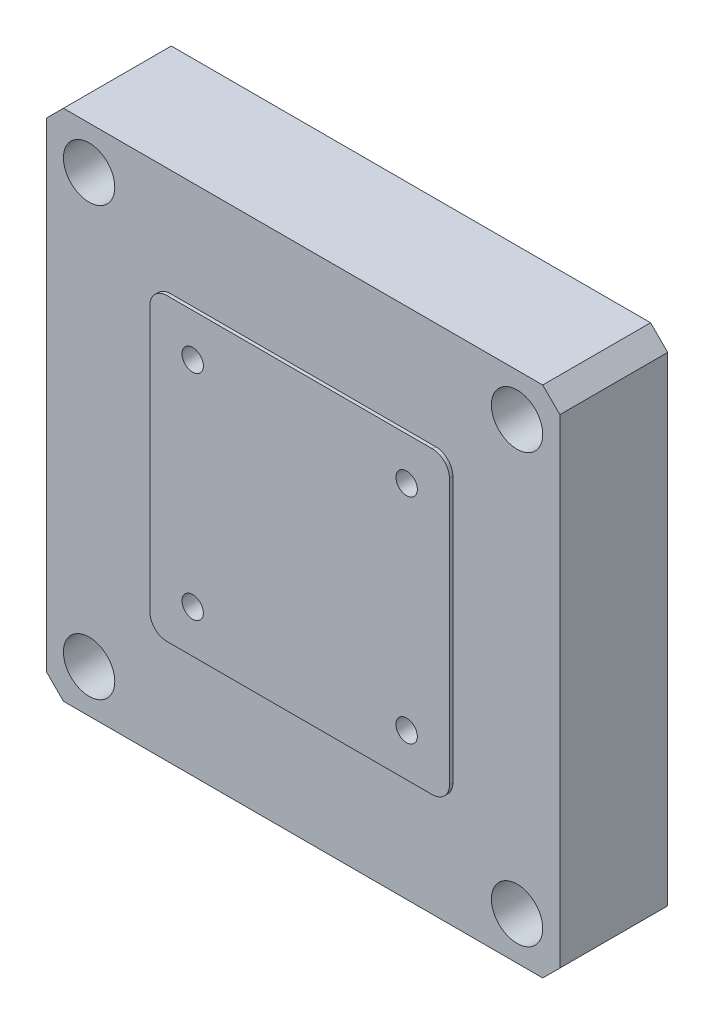
ISO-10303-21;
HEADER;
FILE_DESCRIPTION(('STEP AP214'),'2;1');
FILE_NAME('part.step','',(''),(''),'','','');
FILE_SCHEMA(('AUTOMOTIVE_DESIGN { 1 0 10303 214 1 1 1 1 }'));
ENDSEC;
DATA;
#1=APPLICATION_CONTEXT('core data for automotive mechanical design processes');
#2=APPLICATION_PROTOCOL_DEFINITION('international standard','automotive_design',2000,#1);
#3=PRODUCT_CONTEXT('',#1,'mechanical');
#4=PRODUCT('Part','Part','',(#3));
#5=PRODUCT_RELATED_PRODUCT_CATEGORY('part','',(#4));
#6=PRODUCT_DEFINITION_FORMATION('','',#4);
#7=PRODUCT_DEFINITION_CONTEXT('part definition',#1,'design');
#8=PRODUCT_DEFINITION('design','',#6,#7);
#9=PRODUCT_DEFINITION_SHAPE('','',#8);
#10=(LENGTH_UNIT() NAMED_UNIT(*) SI_UNIT(.MILLI.,.METRE.));
#11=(NAMED_UNIT(*) PLANE_ANGLE_UNIT() SI_UNIT($,.RADIAN.));
#12=(NAMED_UNIT(*) SI_UNIT($,.STERADIAN.) SOLID_ANGLE_UNIT());
#13=UNCERTAINTY_MEASURE_WITH_UNIT(LENGTH_MEASURE(1.E-05),#10,'distance_accuracy_value','');
#14=(GEOMETRIC_REPRESENTATION_CONTEXT(3) GLOBAL_UNCERTAINTY_ASSIGNED_CONTEXT((#13)) GLOBAL_UNIT_ASSIGNED_CONTEXT((#10,
#11,#12)) REPRESENTATION_CONTEXT('',''));
#15=CARTESIAN_POINT('',(0.,0.,0.));
#16=DIRECTION('',(0.,0.,1.));
#17=DIRECTION('',(1.,0.,0.));
#18=AXIS2_PLACEMENT_3D('',#15,#16,#17);
#19=CARTESIAN_POINT('',(30.,30.,12.6));
#20=DIRECTION('',(-1.,0.,0.));
#21=DIRECTION('',(0.,-1.,0.));
#22=AXIS2_PLACEMENT_3D('',#19,#20,#21);
#23=PLANE('',#22);
#24=DIRECTION('',(0.,1.,0.));
#25=VECTOR('',#24,1.);
#26=CARTESIAN_POINT('',(30.,30.,12.6));
#27=LINE('',#26,#25);
#28=CARTESIAN_POINT('',(30.,-28.,12.6));
#29=VERTEX_POINT('',#28);
#30=CARTESIAN_POINT('',(30.,28.,12.6));
#31=VERTEX_POINT('',#30);
#32=EDGE_CURVE('E301',#29,#31,#27,.T.);
#33=ORIENTED_EDGE('',*,*,#32,.F.);
#34=DIRECTION('',(0.,0.,-1.));
#35=VECTOR('',#34,1.);
#36=CARTESIAN_POINT('',(30.,-28.,12.6));
#37=LINE('',#36,#35);
#38=CARTESIAN_POINT('',(30.,-28.,0.));
#39=VERTEX_POINT('',#38);
#40=EDGE_CURVE('E373',#29,#39,#37,.T.);
#41=ORIENTED_EDGE('',*,*,#40,.T.);
#42=DIRECTION('',(0.,1.,0.));
#43=VECTOR('',#42,1.);
#44=CARTESIAN_POINT('',(30.,30.,0.));
#45=LINE('',#44,#43);
#46=CARTESIAN_POINT('',(30.,28.,0.));
#47=VERTEX_POINT('',#46);
#48=EDGE_CURVE('E287',#39,#47,#45,.T.);
#49=ORIENTED_EDGE('',*,*,#48,.T.);
#50=DIRECTION('',(0.,0.,1.));
#51=VECTOR('',#50,1.);
#52=CARTESIAN_POINT('',(30.,28.,12.6));
#53=LINE('',#52,#51);
#54=EDGE_CURVE('E370',#47,#31,#53,.T.);
#55=ORIENTED_EDGE('',*,*,#54,.T.);
#56=EDGE_LOOP('',(#33,#41,#49,#55));
#57=FACE_BOUND('',#56,.T.);
#58=ADVANCED_FACE('F41',(#57),#23,.F.);
#59=CARTESIAN_POINT('',(-30.,30.,12.6));
#60=DIRECTION('',(0.,-1.,0.));
#61=DIRECTION('',(0.,0.,-1.));
#62=AXIS2_PLACEMENT_3D('',#59,#60,#61);
#63=PLANE('',#62);
#64=DIRECTION('',(-1.,0.,0.));
#65=VECTOR('',#64,1.);
#66=CARTESIAN_POINT('',(-30.,30.,12.6));
#67=LINE('',#66,#65);
#68=CARTESIAN_POINT('',(28.,30.,12.6));
#69=VERTEX_POINT('',#68);
#70=CARTESIAN_POINT('',(-28.,30.,12.6));
#71=VERTEX_POINT('',#70);
#72=EDGE_CURVE('E305',#69,#71,#67,.T.);
#73=ORIENTED_EDGE('',*,*,#72,.F.);
#74=DIRECTION('',(0.,0.,-1.));
#75=VECTOR('',#74,1.);
#76=CARTESIAN_POINT('',(28.,30.,12.6));
#77=LINE('',#76,#75);
#78=CARTESIAN_POINT('',(28.,30.,0.));
#79=VERTEX_POINT('',#78);
#80=EDGE_CURVE('E380',#69,#79,#77,.T.);
#81=ORIENTED_EDGE('',*,*,#80,.T.);
#82=DIRECTION('',(-1.,0.,0.));
#83=VECTOR('',#82,1.);
#84=CARTESIAN_POINT('',(-30.,30.,0.));
#85=LINE('',#84,#83);
#86=CARTESIAN_POINT('',(-28.,30.,0.));
#87=VERTEX_POINT('',#86);
#88=EDGE_CURVE('E322',#79,#87,#85,.T.);
#89=ORIENTED_EDGE('',*,*,#88,.T.);
#90=DIRECTION('',(0.,0.,1.));
#91=VECTOR('',#90,1.);
#92=CARTESIAN_POINT('',(-28.,30.,12.6));
#93=LINE('',#92,#91);
#94=EDGE_CURVE('E377',#87,#71,#93,.T.);
#95=ORIENTED_EDGE('',*,*,#94,.T.);
#96=EDGE_LOOP('',(#73,#81,#89,#95));
#97=FACE_BOUND('',#96,.T.);
#98=ADVANCED_FACE('F474',(#97),#63,.F.);
#99=CARTESIAN_POINT('',(-30.,30.,12.6));
#100=DIRECTION('',(1.,0.,0.));
#101=DIRECTION('',(0.,1.,0.));
#102=AXIS2_PLACEMENT_3D('',#99,#100,#101);
#103=PLANE('',#102);
#104=DIRECTION('',(0.,-1.,0.));
#105=VECTOR('',#104,1.);
#106=CARTESIAN_POINT('',(-30.,30.,0.));
#107=LINE('',#106,#105);
#108=CARTESIAN_POINT('',(-30.,28.,0.));
#109=VERTEX_POINT('',#108);
#110=CARTESIAN_POINT('',(-30.,-28.,0.));
#111=VERTEX_POINT('',#110);
#112=EDGE_CURVE('E326',#109,#111,#107,.T.);
#113=ORIENTED_EDGE('',*,*,#112,.T.);
#114=DIRECTION('',(0.,0.,1.));
#115=VECTOR('',#114,1.);
#116=CARTESIAN_POINT('',(-30.,-28.,12.6));
#117=LINE('',#116,#115);
#118=CARTESIAN_POINT('',(-30.,-28.,12.6));
#119=VERTEX_POINT('',#118);
#120=EDGE_CURVE('E355',#111,#119,#117,.T.);
#121=ORIENTED_EDGE('',*,*,#120,.T.);
#122=DIRECTION('',(0.,-1.,0.));
#123=VECTOR('',#122,1.);
#124=CARTESIAN_POINT('',(-30.,30.,12.6));
#125=LINE('',#124,#123);
#126=CARTESIAN_POINT('',(-30.,28.,12.6));
#127=VERTEX_POINT('',#126);
#128=EDGE_CURVE('E310',#127,#119,#125,.T.);
#129=ORIENTED_EDGE('',*,*,#128,.F.);
#130=DIRECTION('',(0.,0.,-1.));
#131=VECTOR('',#130,1.);
#132=CARTESIAN_POINT('',(-30.,28.,12.6));
#133=LINE('',#132,#131);
#134=EDGE_CURVE('E351',#127,#109,#133,.T.);
#135=ORIENTED_EDGE('',*,*,#134,.T.);
#136=EDGE_LOOP('',(#113,#121,#129,#135));
#137=FACE_BOUND('',#136,.T.);
#138=ADVANCED_FACE('F480',(#137),#103,.F.);
#139=CARTESIAN_POINT('',(-30.,-30.,12.6));
#140=DIRECTION('',(0.,1.,0.));
#141=DIRECTION('',(0.,0.,1.));
#142=AXIS2_PLACEMENT_3D('',#139,#140,#141);
#143=PLANE('',#142);
#144=DIRECTION('',(1.,0.,0.));
#145=VECTOR('',#144,1.);
#146=CARTESIAN_POINT('',(-30.,-30.,12.6));
#147=LINE('',#146,#145);
#148=CARTESIAN_POINT('',(-28.,-30.,12.6));
#149=VERTEX_POINT('',#148);
#150=CARTESIAN_POINT('',(28.,-30.,12.6));
#151=VERTEX_POINT('',#150);
#152=EDGE_CURVE('E314',#149,#151,#147,.T.);
#153=ORIENTED_EDGE('',*,*,#152,.F.);
#154=DIRECTION('',(0.,0.,-1.));
#155=VECTOR('',#154,1.);
#156=CARTESIAN_POINT('',(-28.,-30.,12.6));
#157=LINE('',#156,#155);
#158=CARTESIAN_POINT('',(-28.,-30.,0.));
#159=VERTEX_POINT('',#158);
#160=EDGE_CURVE('E335',#149,#159,#157,.T.);
#161=ORIENTED_EDGE('',*,*,#160,.T.);
#162=DIRECTION('',(1.,0.,0.));
#163=VECTOR('',#162,1.);
#164=CARTESIAN_POINT('',(-30.,-30.,0.));
#165=LINE('',#164,#163);
#166=CARTESIAN_POINT('',(28.,-30.,0.));
#167=VERTEX_POINT('',#166);
#168=EDGE_CURVE('E306',#159,#167,#165,.T.);
#169=ORIENTED_EDGE('',*,*,#168,.T.);
#170=DIRECTION('',(0.,0.,1.));
#171=VECTOR('',#170,1.);
#172=CARTESIAN_POINT('',(28.,-30.,12.6));
#173=LINE('',#172,#171);
#174=EDGE_CURVE('E318',#167,#151,#173,.T.);
#175=ORIENTED_EDGE('',*,*,#174,.T.);
#176=EDGE_LOOP('',(#153,#161,#169,#175));
#177=FACE_BOUND('',#176,.T.);
#178=ADVANCED_FACE('F518',(#177),#143,.F.);
#179=CARTESIAN_POINT('',(0.,0.,12.6));
#180=DIRECTION('',(0.,0.,1.));
#181=DIRECTION('',(1.,0.,0.));
#182=AXIS2_PLACEMENT_3D('',#179,#180,#181);
#183=PLANE('',#182);
#184=CARTESIAN_POINT('',(-25.,25.,12.6));
#185=DIRECTION('',(0.,0.,1.));
#186=DIRECTION('',(1.,0.,0.));
#187=AXIS2_PLACEMENT_3D('',#184,#185,#186);
#188=CIRCLE('',#187,3.00000000000001);
#189=CARTESIAN_POINT('',(-22.,25.,12.6));
#190=VERTEX_POINT('',#189);
#191=EDGE_CURVE('E205',#190,#190,#188,.T.);
#192=ORIENTED_EDGE('',*,*,#191,.F.);
#193=EDGE_LOOP('',(#192));
#194=FACE_BOUND('',#193,.T.);
#195=CARTESIAN_POINT('',(25.,25.,12.6));
#196=DIRECTION('',(0.,0.,1.));
#197=DIRECTION('',(1.,0.,0.));
#198=AXIS2_PLACEMENT_3D('',#195,#196,#197);
#199=CIRCLE('',#198,3.00000000000001);
#200=CARTESIAN_POINT('',(28.,25.,12.6));
#201=VERTEX_POINT('',#200);
#202=EDGE_CURVE('E221',#201,#201,#199,.T.);
#203=ORIENTED_EDGE('',*,*,#202,.F.);
#204=EDGE_LOOP('',(#203));
#205=FACE_BOUND('',#204,.T.);
#206=CARTESIAN_POINT('',(-25.,-25.,12.6));
#207=DIRECTION('',(0.,0.,1.));
#208=DIRECTION('',(1.,0.,0.));
#209=AXIS2_PLACEMENT_3D('',#206,#207,#208);
#210=CIRCLE('',#209,3.00000000000001);
#211=CARTESIAN_POINT('',(-22.,-25.,12.6));
#212=VERTEX_POINT('',#211);
#213=EDGE_CURVE('E237',#212,#212,#210,.T.);
#214=ORIENTED_EDGE('',*,*,#213,.F.);
#215=EDGE_LOOP('',(#214));
#216=FACE_BOUND('',#215,.T.);
#217=CARTESIAN_POINT('',(25.,-25.,12.6));
#218=DIRECTION('',(0.,0.,1.));
#219=DIRECTION('',(1.,0.,0.));
#220=AXIS2_PLACEMENT_3D('',#217,#218,#219);
#221=CIRCLE('',#220,3.00000000000001);
#222=CARTESIAN_POINT('',(28.,-25.,12.6));
#223=VERTEX_POINT('',#222);
#224=EDGE_CURVE('E253',#223,#223,#221,.T.);
#225=ORIENTED_EDGE('',*,*,#224,.F.);
#226=EDGE_LOOP('',(#225));
#227=FACE_BOUND('',#226,.T.);
#228=DIRECTION('',(0.,1.,0.));
#229=VECTOR('',#228,1.);
#230=CARTESIAN_POINT('',(17.5,17.5,12.6));
#231=LINE('',#230,#229);
#232=CARTESIAN_POINT('',(17.5,-15.5,12.6));
#233=VERTEX_POINT('',#232);
#234=CARTESIAN_POINT('',(17.5,15.5,12.6));
#235=VERTEX_POINT('',#234);
#236=EDGE_CURVE('E269',#233,#235,#231,.T.);
#237=ORIENTED_EDGE('',*,*,#236,.F.);
#238=CARTESIAN_POINT('',(15.5,-15.5,12.6));
#239=DIRECTION('',(0.,0.,1.));
#240=DIRECTION('',(1.,0.,0.));
#241=AXIS2_PLACEMENT_3D('',#238,#239,#240);
#242=CIRCLE('',#241,2.);
#243=CARTESIAN_POINT('',(15.5,-17.5,12.6));
#244=VERTEX_POINT('',#243);
#245=EDGE_CURVE('E423',#233,#244,#242,.F.);
#246=ORIENTED_EDGE('',*,*,#245,.T.);
#247=DIRECTION('',(1.,0.,0.));
#248=VECTOR('',#247,1.);
#249=CARTESIAN_POINT('',(-17.5,-17.5,12.6));
#250=LINE('',#249,#248);
#251=CARTESIAN_POINT('',(-15.5,-17.5,12.6));
#252=VERTEX_POINT('',#251);
#253=EDGE_CURVE('E275',#252,#244,#250,.T.);
#254=ORIENTED_EDGE('',*,*,#253,.F.);
#255=CARTESIAN_POINT('',(-15.5,-15.5,12.6));
#256=DIRECTION('',(0.,0.,1.));
#257=DIRECTION('',(1.,0.,0.));
#258=AXIS2_PLACEMENT_3D('',#255,#256,#257);
#259=CIRCLE('',#258,2.);
#260=CARTESIAN_POINT('',(-17.5,-15.5,12.6));
#261=VERTEX_POINT('',#260);
#262=EDGE_CURVE('E426',#252,#261,#259,.F.);
#263=ORIENTED_EDGE('',*,*,#262,.T.);
#264=DIRECTION('',(0.,-1.,0.));
#265=VECTOR('',#264,1.);
#266=CARTESIAN_POINT('',(-17.5,17.5,12.6));
#267=LINE('',#266,#265);
#268=CARTESIAN_POINT('',(-17.5,15.5,12.6));
#269=VERTEX_POINT('',#268);
#270=EDGE_CURVE('E294',#269,#261,#267,.T.);
#271=ORIENTED_EDGE('',*,*,#270,.F.);
#272=CARTESIAN_POINT('',(-15.5,15.5,12.6));
#273=DIRECTION('',(0.,0.,1.));
#274=DIRECTION('',(1.,0.,0.));
#275=AXIS2_PLACEMENT_3D('',#272,#273,#274);
#276=CIRCLE('',#275,2.);
#277=CARTESIAN_POINT('',(-15.5,17.5,12.6));
#278=VERTEX_POINT('',#277);
#279=EDGE_CURVE('E11',#269,#278,#276,.F.);
#280=ORIENTED_EDGE('',*,*,#279,.T.);
#281=DIRECTION('',(-1.,0.,0.));
#282=VECTOR('',#281,1.);
#283=CARTESIAN_POINT('',(-17.5,17.5,12.6));
#284=LINE('',#283,#282);
#285=CARTESIAN_POINT('',(15.5,17.5,12.6));
#286=VERTEX_POINT('',#285);
#287=EDGE_CURVE('E291',#286,#278,#284,.T.);
#288=ORIENTED_EDGE('',*,*,#287,.F.);
#289=CARTESIAN_POINT('',(15.5,15.5,12.6));
#290=DIRECTION('',(0.,0.,1.));
#291=DIRECTION('',(1.,0.,0.));
#292=AXIS2_PLACEMENT_3D('',#289,#290,#291);
#293=CIRCLE('',#292,2.);
#294=EDGE_CURVE('E50',#286,#235,#293,.F.);
#295=ORIENTED_EDGE('',*,*,#294,.T.);
#296=EDGE_LOOP('',(#237,#246,#254,#263,#271,#280,#288,#295));
#297=FACE_BOUND('',#296,.T.);
#298=ORIENTED_EDGE('',*,*,#128,.T.);
#299=DIRECTION('',(-0.707106781186548,0.707106781186548,0.));
#300=VECTOR('',#299,1.);
#301=CARTESIAN_POINT('',(-29.,-29.,12.6));
#302=LINE('',#301,#300);
#303=EDGE_CURVE('E367',#119,#149,#302,.F.);
#304=ORIENTED_EDGE('',*,*,#303,.T.);
#305=ORIENTED_EDGE('',*,*,#152,.T.);
#306=DIRECTION('',(-0.707106781186548,-0.707106781186547,0.));
#307=VECTOR('',#306,1.);
#308=CARTESIAN_POINT('',(29.,-29.,12.6));
#309=LINE('',#308,#307);
#310=EDGE_CURVE('E364',#151,#29,#309,.F.);
#311=ORIENTED_EDGE('',*,*,#310,.T.);
#312=ORIENTED_EDGE('',*,*,#32,.T.);
#313=DIRECTION('',(0.707106781186548,-0.707106781186548,0.));
#314=VECTOR('',#313,1.);
#315=CARTESIAN_POINT('',(29.,29.,12.6));
#316=LINE('',#315,#314);
#317=EDGE_CURVE('E361',#31,#69,#316,.F.);
#318=ORIENTED_EDGE('',*,*,#317,.T.);
#319=ORIENTED_EDGE('',*,*,#72,.T.);
#320=DIRECTION('',(0.707106781186548,0.707106781186548,0.));
#321=VECTOR('',#320,1.);
#322=CARTESIAN_POINT('',(-29.,29.,12.6));
#323=LINE('',#322,#321);
#324=EDGE_CURVE('E358',#71,#127,#323,.F.);
#325=ORIENTED_EDGE('',*,*,#324,.T.);
#326=EDGE_LOOP('',(#298,#304,#305,#311,#312,#318,#319,#325));
#327=FACE_BOUND('',#326,.T.);
#328=ADVANCED_FACE('F430',(#194,#205,#216,#227,#297,#327),#183,.T.);
#329=CARTESIAN_POINT('',(0.,0.,0.));
#330=DIRECTION('',(0.,0.,1.));
#331=DIRECTION('',(1.,0.,0.));
#332=AXIS2_PLACEMENT_3D('',#329,#330,#331);
#333=PLANE('',#332);
#334=CARTESIAN_POINT('',(-25.,25.,0.));
#335=DIRECTION('',(0.,0.,1.));
#336=DIRECTION('',(1.,0.,0.));
#337=AXIS2_PLACEMENT_3D('',#334,#335,#336);
#338=CIRCLE('',#337,1.70000000000001);
#339=CARTESIAN_POINT('',(-23.3,25.,0.));
#340=VERTEX_POINT('',#339);
#341=EDGE_CURVE('E217',#340,#340,#338,.T.);
#342=ORIENTED_EDGE('',*,*,#341,.T.);
#343=EDGE_LOOP('',(#342));
#344=FACE_BOUND('',#343,.T.);
#345=CARTESIAN_POINT('',(25.,25.,0.));
#346=DIRECTION('',(0.,0.,1.));
#347=DIRECTION('',(1.,0.,0.));
#348=AXIS2_PLACEMENT_3D('',#345,#346,#347);
#349=CIRCLE('',#348,1.70000000000001);
#350=CARTESIAN_POINT('',(26.7,25.,0.));
#351=VERTEX_POINT('',#350);
#352=EDGE_CURVE('E233',#351,#351,#349,.T.);
#353=ORIENTED_EDGE('',*,*,#352,.T.);
#354=EDGE_LOOP('',(#353));
#355=FACE_BOUND('',#354,.T.);
#356=CARTESIAN_POINT('',(-25.,-25.,0.));
#357=DIRECTION('',(0.,0.,1.));
#358=DIRECTION('',(1.,0.,0.));
#359=AXIS2_PLACEMENT_3D('',#356,#357,#358);
#360=CIRCLE('',#359,1.70000000000001);
#361=CARTESIAN_POINT('',(-23.3,-25.,0.));
#362=VERTEX_POINT('',#361);
#363=EDGE_CURVE('E249',#362,#362,#360,.T.);
#364=ORIENTED_EDGE('',*,*,#363,.T.);
#365=EDGE_LOOP('',(#364));
#366=FACE_BOUND('',#365,.T.);
#367=CARTESIAN_POINT('',(25.,-25.,0.));
#368=DIRECTION('',(0.,0.,1.));
#369=DIRECTION('',(1.,0.,0.));
#370=AXIS2_PLACEMENT_3D('',#367,#368,#369);
#371=CIRCLE('',#370,1.70000000000001);
#372=CARTESIAN_POINT('',(26.7,-25.,0.));
#373=VERTEX_POINT('',#372);
#374=EDGE_CURVE('E265',#373,#373,#371,.T.);
#375=ORIENTED_EDGE('',*,*,#374,.T.);
#376=EDGE_LOOP('',(#375));
#377=FACE_BOUND('',#376,.T.);
#378=ORIENTED_EDGE('',*,*,#168,.F.);
#379=DIRECTION('',(0.707106781186548,-0.707106781186548,0.));
#380=VECTOR('',#379,1.);
#381=CARTESIAN_POINT('',(-28.,-30.,0.));
#382=LINE('',#381,#380);
#383=EDGE_CURVE('E348',#159,#111,#382,.F.);
#384=ORIENTED_EDGE('',*,*,#383,.T.);
#385=ORIENTED_EDGE('',*,*,#112,.F.);
#386=DIRECTION('',(-0.707106781186548,-0.707106781186548,0.));
#387=VECTOR('',#386,1.);
#388=CARTESIAN_POINT('',(-30.,28.,0.));
#389=LINE('',#388,#387);
#390=EDGE_CURVE('E339',#109,#87,#389,.F.);
#391=ORIENTED_EDGE('',*,*,#390,.T.);
#392=ORIENTED_EDGE('',*,*,#88,.F.);
#393=DIRECTION('',(-0.707106781186548,0.707106781186548,0.));
#394=VECTOR('',#393,1.);
#395=CARTESIAN_POINT('',(28.,30.,0.));
#396=LINE('',#395,#394);
#397=EDGE_CURVE('E342',#79,#47,#396,.F.);
#398=ORIENTED_EDGE('',*,*,#397,.T.);
#399=ORIENTED_EDGE('',*,*,#48,.F.);
#400=DIRECTION('',(0.707106781186548,0.707106781186547,0.));
#401=VECTOR('',#400,1.);
#402=CARTESIAN_POINT('',(30.,-28.,0.));
#403=LINE('',#402,#401);
#404=EDGE_CURVE('E345',#39,#167,#403,.F.);
#405=ORIENTED_EDGE('',*,*,#404,.T.);
#406=EDGE_LOOP('',(#378,#384,#385,#391,#392,#398,#399,#405));
#407=FACE_BOUND('',#406,.T.);
#408=ADVANCED_FACE('F490',(#344,#355,#366,#377,#407),#333,.F.);
#409=CARTESIAN_POINT('',(-28.,-30.,12.6));
#410=DIRECTION('',(0.707106781186547,0.707106781186547,0.));
#411=DIRECTION('',(0.,0.,-1.));
#412=AXIS2_PLACEMENT_3D('',#409,#410,#411);
#413=PLANE('',#412);
#414=ORIENTED_EDGE('',*,*,#303,.F.);
#415=ORIENTED_EDGE('',*,*,#120,.F.);
#416=ORIENTED_EDGE('',*,*,#383,.F.);
#417=ORIENTED_EDGE('',*,*,#160,.F.);
#418=EDGE_LOOP('',(#414,#415,#416,#417));
#419=FACE_BOUND('',#418,.T.);
#420=ADVANCED_FACE('F486',(#419),#413,.F.);
#421=CARTESIAN_POINT('',(30.,-28.,12.6));
#422=DIRECTION('',(-0.707106781186547,0.707106781186548,0.));
#423=DIRECTION('',(0.,0.,-1.));
#424=AXIS2_PLACEMENT_3D('',#421,#422,#423);
#425=PLANE('',#424);
#426=ORIENTED_EDGE('',*,*,#310,.F.);
#427=ORIENTED_EDGE('',*,*,#174,.F.);
#428=ORIENTED_EDGE('',*,*,#404,.F.);
#429=ORIENTED_EDGE('',*,*,#40,.F.);
#430=EDGE_LOOP('',(#426,#427,#428,#429));
#431=FACE_BOUND('',#430,.T.);
#432=ADVANCED_FACE('F489',(#431),#425,.F.);
#433=CARTESIAN_POINT('',(28.,30.,12.6));
#434=DIRECTION('',(-0.707106781186547,-0.707106781186547,0.));
#435=DIRECTION('',(0.,0.,-1.));
#436=AXIS2_PLACEMENT_3D('',#433,#434,#435);
#437=PLANE('',#436);
#438=ORIENTED_EDGE('',*,*,#317,.F.);
#439=ORIENTED_EDGE('',*,*,#54,.F.);
#440=ORIENTED_EDGE('',*,*,#397,.F.);
#441=ORIENTED_EDGE('',*,*,#80,.F.);
#442=EDGE_LOOP('',(#438,#439,#440,#441));
#443=FACE_BOUND('',#442,.T.);
#444=ADVANCED_FACE('F494',(#443),#437,.F.);
#445=CARTESIAN_POINT('',(-30.,28.,12.6));
#446=DIRECTION('',(0.707106781186547,-0.707106781186547,0.));
#447=DIRECTION('',(0.,0.,-1.));
#448=AXIS2_PLACEMENT_3D('',#445,#446,#447);
#449=PLANE('',#448);
#450=ORIENTED_EDGE('',*,*,#324,.F.);
#451=ORIENTED_EDGE('',*,*,#94,.F.);
#452=ORIENTED_EDGE('',*,*,#390,.F.);
#453=ORIENTED_EDGE('',*,*,#134,.F.);
#454=EDGE_LOOP('',(#450,#451,#452,#453));
#455=FACE_BOUND('',#454,.T.);
#456=ADVANCED_FACE('F497',(#455),#449,.F.);
#457=CARTESIAN_POINT('',(17.5,17.5,13.));
#458=DIRECTION('',(-1.,0.,0.));
#459=DIRECTION('',(0.,-1.,0.));
#460=AXIS2_PLACEMENT_3D('',#457,#458,#459);
#461=PLANE('',#460);
#462=DIRECTION('',(0.,1.,0.));
#463=VECTOR('',#462,1.);
#464=CARTESIAN_POINT('',(17.5,17.5,13.));
#465=LINE('',#464,#463);
#466=CARTESIAN_POINT('',(17.5,-15.5,13.));
#467=VERTEX_POINT('',#466);
#468=CARTESIAN_POINT('',(17.5,15.5,13.));
#469=VERTEX_POINT('',#468);
#470=EDGE_CURVE('E270',#467,#469,#465,.T.);
#471=ORIENTED_EDGE('',*,*,#470,.F.);
#472=DIRECTION('',(0.,0.,-1.));
#473=VECTOR('',#472,1.);
#474=CARTESIAN_POINT('',(17.5,-15.5,13.));
#475=LINE('',#474,#473);
#476=EDGE_CURVE('E387',#467,#233,#475,.T.);
#477=ORIENTED_EDGE('',*,*,#476,.T.);
#478=ORIENTED_EDGE('',*,*,#236,.T.);
#479=DIRECTION('',(0.,0.,-1.));
#480=VECTOR('',#479,1.);
#481=CARTESIAN_POINT('',(17.5,15.5,13.));
#482=LINE('',#481,#480);
#483=EDGE_CURVE('E384',#235,#469,#482,.F.);
#484=ORIENTED_EDGE('',*,*,#483,.T.);
#485=EDGE_LOOP('',(#471,#477,#478,#484));
#486=FACE_BOUND('',#485,.T.);
#487=ADVANCED_FACE('F434',(#486),#461,.F.);
#488=CARTESIAN_POINT('',(-17.5,17.5,13.));
#489=DIRECTION('',(0.,-1.,0.));
#490=DIRECTION('',(0.,0.,-1.));
#491=AXIS2_PLACEMENT_3D('',#488,#489,#490);
#492=PLANE('',#491);
#493=DIRECTION('',(-1.,0.,0.));
#494=VECTOR('',#493,1.);
#495=CARTESIAN_POINT('',(-17.5,17.5,13.));
#496=LINE('',#495,#494);
#497=CARTESIAN_POINT('',(15.5,17.5,13.));
#498=VERTEX_POINT('',#497);
#499=CARTESIAN_POINT('',(-15.5,17.5,13.));
#500=VERTEX_POINT('',#499);
#501=EDGE_CURVE('E274',#498,#500,#496,.T.);
#502=ORIENTED_EDGE('',*,*,#501,.F.);
#503=DIRECTION('',(0.,0.,-1.));
#504=VECTOR('',#503,1.);
#505=CARTESIAN_POINT('',(15.5,17.5,13.));
#506=LINE('',#505,#504);
#507=EDGE_CURVE('E420',#498,#286,#506,.T.);
#508=ORIENTED_EDGE('',*,*,#507,.T.);
#509=ORIENTED_EDGE('',*,*,#287,.T.);
#510=DIRECTION('',(0.,0.,-1.));
#511=VECTOR('',#510,1.);
#512=CARTESIAN_POINT('',(-15.5,17.5,13.));
#513=LINE('',#512,#511);
#514=EDGE_CURVE('E417',#278,#500,#513,.F.);
#515=ORIENTED_EDGE('',*,*,#514,.T.);
#516=EDGE_LOOP('',(#502,#508,#509,#515));
#517=FACE_BOUND('',#516,.T.);
#518=ADVANCED_FACE('F443',(#517),#492,.F.);
#519=CARTESIAN_POINT('',(-17.5,17.5,13.));
#520=DIRECTION('',(1.,0.,0.));
#521=DIRECTION('',(0.,1.,0.));
#522=AXIS2_PLACEMENT_3D('',#519,#520,#521);
#523=PLANE('',#522);
#524=ORIENTED_EDGE('',*,*,#270,.T.);
#525=DIRECTION('',(0.,0.,-1.));
#526=VECTOR('',#525,1.);
#527=CARTESIAN_POINT('',(-17.5,-15.5,13.));
#528=LINE('',#527,#526);
#529=CARTESIAN_POINT('',(-17.5,-15.5,13.));
#530=VERTEX_POINT('',#529);
#531=EDGE_CURVE('E414',#261,#530,#528,.F.);
#532=ORIENTED_EDGE('',*,*,#531,.T.);
#533=DIRECTION('',(0.,-1.,0.));
#534=VECTOR('',#533,1.);
#535=CARTESIAN_POINT('',(-17.5,17.5,13.));
#536=LINE('',#535,#534);
#537=CARTESIAN_POINT('',(-17.5,15.5,13.));
#538=VERTEX_POINT('',#537);
#539=EDGE_CURVE('E279',#538,#530,#536,.T.);
#540=ORIENTED_EDGE('',*,*,#539,.F.);
#541=DIRECTION('',(0.,0.,-1.));
#542=VECTOR('',#541,1.);
#543=CARTESIAN_POINT('',(-17.5,15.5,13.));
#544=LINE('',#543,#542);
#545=EDGE_CURVE('E410',#538,#269,#544,.T.);
#546=ORIENTED_EDGE('',*,*,#545,.T.);
#547=EDGE_LOOP('',(#524,#532,#540,#546));
#548=FACE_BOUND('',#547,.T.);
#549=ADVANCED_FACE('F450',(#548),#523,.F.);
#550=CARTESIAN_POINT('',(-17.5,-17.5,13.));
#551=DIRECTION('',(0.,1.,0.));
#552=DIRECTION('',(0.,0.,1.));
#553=AXIS2_PLACEMENT_3D('',#550,#551,#552);
#554=PLANE('',#553);
#555=ORIENTED_EDGE('',*,*,#253,.T.);
#556=DIRECTION('',(0.,0.,-1.));
#557=VECTOR('',#556,1.);
#558=CARTESIAN_POINT('',(15.5,-17.5,13.));
#559=LINE('',#558,#557);
#560=CARTESIAN_POINT('',(15.5,-17.5,13.));
#561=VERTEX_POINT('',#560);
#562=EDGE_CURVE('E395',#244,#561,#559,.F.);
#563=ORIENTED_EDGE('',*,*,#562,.T.);
#564=DIRECTION('',(1.,0.,0.));
#565=VECTOR('',#564,1.);
#566=CARTESIAN_POINT('',(-17.5,-17.5,13.));
#567=LINE('',#566,#565);
#568=CARTESIAN_POINT('',(-15.5,-17.5,13.));
#569=VERTEX_POINT('',#568);
#570=EDGE_CURVE('E283',#569,#561,#567,.T.);
#571=ORIENTED_EDGE('',*,*,#570,.F.);
#572=DIRECTION('',(0.,0.,-1.));
#573=VECTOR('',#572,1.);
#574=CARTESIAN_POINT('',(-15.5,-17.5,13.));
#575=LINE('',#574,#573);
#576=EDGE_CURVE('E391',#569,#252,#575,.T.);
#577=ORIENTED_EDGE('',*,*,#576,.T.);
#578=EDGE_LOOP('',(#555,#563,#571,#577));
#579=FACE_BOUND('',#578,.T.);
#580=ADVANCED_FACE('F458',(#579),#554,.F.);
#581=CARTESIAN_POINT('',(0.,0.,13.));
#582=DIRECTION('',(0.,0.,1.));
#583=DIRECTION('',(1.,0.,0.));
#584=AXIS2_PLACEMENT_3D('',#581,#582,#583);
#585=PLANE('',#584);
#586=CARTESIAN_POINT('',(-12.5,12.5,13.));
#587=DIRECTION('',(0.,0.,1.));
#588=DIRECTION('',(1.,0.,0.));
#589=AXIS2_PLACEMENT_3D('',#586,#587,#588);
#590=CIRCLE('',#589,1.25);
#591=CARTESIAN_POINT('',(-11.25,12.5,13.));
#592=VERTEX_POINT('',#591);
#593=EDGE_CURVE('E176',#592,#592,#590,.T.);
#594=ORIENTED_EDGE('',*,*,#593,.F.);
#595=EDGE_LOOP('',(#594));
#596=FACE_BOUND('',#595,.T.);
#597=CARTESIAN_POINT('',(12.5,12.5,13.));
#598=DIRECTION('',(0.,0.,1.));
#599=DIRECTION('',(1.,0.,0.));
#600=AXIS2_PLACEMENT_3D('',#597,#598,#599);
#601=CIRCLE('',#600,1.25);
#602=CARTESIAN_POINT('',(13.75,12.5,13.));
#603=VERTEX_POINT('',#602);
#604=EDGE_CURVE('E175',#603,#603,#601,.T.);
#605=ORIENTED_EDGE('',*,*,#604,.F.);
#606=EDGE_LOOP('',(#605));
#607=FACE_BOUND('',#606,.T.);
#608=CARTESIAN_POINT('',(12.5,-12.5,13.));
#609=DIRECTION('',(0.,0.,1.));
#610=DIRECTION('',(1.,0.,0.));
#611=AXIS2_PLACEMENT_3D('',#608,#609,#610);
#612=CIRCLE('',#611,1.25);
#613=CARTESIAN_POINT('',(13.75,-12.5,13.));
#614=VERTEX_POINT('',#613);
#615=EDGE_CURVE('E189',#614,#614,#612,.T.);
#616=ORIENTED_EDGE('',*,*,#615,.F.);
#617=EDGE_LOOP('',(#616));
#618=FACE_BOUND('',#617,.T.);
#619=CARTESIAN_POINT('',(-12.5,-12.5,13.));
#620=DIRECTION('',(0.,0.,1.));
#621=DIRECTION('',(1.,0.,0.));
#622=AXIS2_PLACEMENT_3D('',#619,#620,#621);
#623=CIRCLE('',#622,1.25);
#624=CARTESIAN_POINT('',(-11.25,-12.5,13.));
#625=VERTEX_POINT('',#624);
#626=EDGE_CURVE('E197',#625,#625,#623,.T.);
#627=ORIENTED_EDGE('',*,*,#626,.F.);
#628=EDGE_LOOP('',(#627));
#629=FACE_BOUND('',#628,.T.);
#630=ORIENTED_EDGE('',*,*,#570,.T.);
#631=CARTESIAN_POINT('',(15.5,-15.5,13.));
#632=DIRECTION('',(0.,0.,1.));
#633=DIRECTION('',(1.,0.,0.));
#634=AXIS2_PLACEMENT_3D('',#631,#632,#633);
#635=CIRCLE('',#634,2.);
#636=EDGE_CURVE('E407',#561,#467,#635,.T.);
#637=ORIENTED_EDGE('',*,*,#636,.T.);
#638=ORIENTED_EDGE('',*,*,#470,.T.);
#639=CARTESIAN_POINT('',(15.5,15.5,13.));
#640=DIRECTION('',(0.,0.,1.));
#641=DIRECTION('',(1.,0.,0.));
#642=AXIS2_PLACEMENT_3D('',#639,#640,#641);
#643=CIRCLE('',#642,2.);
#644=EDGE_CURVE('E401',#469,#498,#643,.T.);
#645=ORIENTED_EDGE('',*,*,#644,.T.);
#646=ORIENTED_EDGE('',*,*,#501,.T.);
#647=CARTESIAN_POINT('',(-15.5,15.5,13.));
#648=DIRECTION('',(0.,0.,1.));
#649=DIRECTION('',(1.,0.,0.));
#650=AXIS2_PLACEMENT_3D('',#647,#648,#649);
#651=CIRCLE('',#650,2.);
#652=EDGE_CURVE('E398',#500,#538,#651,.T.);
#653=ORIENTED_EDGE('',*,*,#652,.T.);
#654=ORIENTED_EDGE('',*,*,#539,.T.);
#655=CARTESIAN_POINT('',(-15.5,-15.5,13.));
#656=DIRECTION('',(0.,0.,1.));
#657=DIRECTION('',(1.,0.,0.));
#658=AXIS2_PLACEMENT_3D('',#655,#656,#657);
#659=CIRCLE('',#658,2.);
#660=EDGE_CURVE('E404',#530,#569,#659,.T.);
#661=ORIENTED_EDGE('',*,*,#660,.T.);
#662=EDGE_LOOP('',(#630,#637,#638,#645,#646,#653,#654,#661));
#663=FACE_BOUND('',#662,.T.);
#664=ADVANCED_FACE('F440',(#596,#607,#618,#629,#663),#585,.T.);
#665=CARTESIAN_POINT('',(15.5,-15.5,13.));
#666=DIRECTION('',(0.,0.,-1.));
#667=DIRECTION('',(-1.,0.,0.));
#668=AXIS2_PLACEMENT_3D('',#665,#666,#667);
#669=CYLINDRICAL_SURFACE('',#668,2.);
#670=ORIENTED_EDGE('',*,*,#636,.F.);
#671=ORIENTED_EDGE('',*,*,#562,.F.);
#672=ORIENTED_EDGE('',*,*,#245,.F.);
#673=ORIENTED_EDGE('',*,*,#476,.F.);
#674=EDGE_LOOP('',(#670,#671,#672,#673));
#675=FACE_BOUND('',#674,.T.);
#676=ADVANCED_FACE('F462',(#675),#669,.T.);
#677=CARTESIAN_POINT('',(-15.5,-15.5,13.));
#678=DIRECTION('',(0.,0.,-1.));
#679=DIRECTION('',(-1.,0.,0.));
#680=AXIS2_PLACEMENT_3D('',#677,#678,#679);
#681=CYLINDRICAL_SURFACE('',#680,2.);
#682=ORIENTED_EDGE('',*,*,#660,.F.);
#683=ORIENTED_EDGE('',*,*,#531,.F.);
#684=ORIENTED_EDGE('',*,*,#262,.F.);
#685=ORIENTED_EDGE('',*,*,#576,.F.);
#686=EDGE_LOOP('',(#682,#683,#684,#685));
#687=FACE_BOUND('',#686,.T.);
#688=ADVANCED_FACE('F453',(#687),#681,.T.);
#689=CARTESIAN_POINT('',(15.5,15.5,13.));
#690=DIRECTION('',(0.,0.,-1.));
#691=DIRECTION('',(-1.,0.,0.));
#692=AXIS2_PLACEMENT_3D('',#689,#690,#691);
#693=CYLINDRICAL_SURFACE('',#692,2.);
#694=ORIENTED_EDGE('',*,*,#644,.F.);
#695=ORIENTED_EDGE('',*,*,#483,.F.);
#696=ORIENTED_EDGE('',*,*,#294,.F.);
#697=ORIENTED_EDGE('',*,*,#507,.F.);
#698=EDGE_LOOP('',(#694,#695,#696,#697));
#699=FACE_BOUND('',#698,.T.);
#700=ADVANCED_FACE('F437',(#699),#693,.T.);
#701=CARTESIAN_POINT('',(-15.5,15.5,13.));
#702=DIRECTION('',(0.,0.,-1.));
#703=DIRECTION('',(-1.,0.,0.));
#704=AXIS2_PLACEMENT_3D('',#701,#702,#703);
#705=CYLINDRICAL_SURFACE('',#704,2.);
#706=ORIENTED_EDGE('',*,*,#652,.F.);
#707=ORIENTED_EDGE('',*,*,#514,.F.);
#708=ORIENTED_EDGE('',*,*,#279,.F.);
#709=ORIENTED_EDGE('',*,*,#545,.F.);
#710=EDGE_LOOP('',(#706,#707,#708,#709));
#711=FACE_BOUND('',#710,.T.);
#712=ADVANCED_FACE('F43',(#711),#705,.T.);
#713=CARTESIAN_POINT('',(25.,-25.,12.6));
#714=DIRECTION('',(0.,0.,1.));
#715=DIRECTION('',(1.,0.,0.));
#716=AXIS2_PLACEMENT_3D('',#713,#714,#715);
#717=CYLINDRICAL_SURFACE('',#716,1.70000000000001);
#718=ORIENTED_EDGE('',*,*,#374,.F.);
#719=EDGE_LOOP('',(#718));
#720=FACE_BOUND('',#719,.T.);
#721=CARTESIAN_POINT('',(25.,-25.,7.6));
#722=DIRECTION('',(0.,0.,1.));
#723=DIRECTION('',(1.,0.,0.));
#724=AXIS2_PLACEMENT_3D('',#721,#722,#723);
#725=CIRCLE('',#724,1.70000000000001);
#726=CARTESIAN_POINT('',(26.7,-25.,7.6));
#727=VERTEX_POINT('',#726);
#728=EDGE_CURVE('E261',#727,#727,#725,.T.);
#729=ORIENTED_EDGE('',*,*,#728,.T.);
#730=EDGE_LOOP('',(#729));
#731=FACE_BOUND('',#730,.T.);
#732=ADVANCED_FACE('F568',(#720,#731),#717,.F.);
#733=CARTESIAN_POINT('',(26.7,-25.,7.6));
#734=DIRECTION('',(0.,0.,-1.));
#735=DIRECTION('',(-1.,0.,0.));
#736=AXIS2_PLACEMENT_3D('',#733,#734,#735);
#737=PLANE('',#736);
#738=ORIENTED_EDGE('',*,*,#728,.F.);
#739=EDGE_LOOP('',(#738));
#740=FACE_BOUND('',#739,.T.);
#741=CARTESIAN_POINT('',(25.,-25.,7.6));
#742=DIRECTION('',(0.,0.,1.));
#743=DIRECTION('',(1.,0.,0.));
#744=AXIS2_PLACEMENT_3D('',#741,#742,#743);
#745=CIRCLE('',#744,3.00000000000001);
#746=CARTESIAN_POINT('',(28.,-25.,7.6));
#747=VERTEX_POINT('',#746);
#748=EDGE_CURVE('E257',#747,#747,#745,.T.);
#749=ORIENTED_EDGE('',*,*,#748,.T.);
#750=EDGE_LOOP('',(#749));
#751=FACE_BOUND('',#750,.T.);
#752=ADVANCED_FACE('F573',(#740,#751),#737,.F.);
#753=CARTESIAN_POINT('',(25.,-25.,12.6));
#754=DIRECTION('',(0.,0.,1.));
#755=DIRECTION('',(1.,0.,0.));
#756=AXIS2_PLACEMENT_3D('',#753,#754,#755);
#757=CYLINDRICAL_SURFACE('',#756,3.00000000000001);
#758=ORIENTED_EDGE('',*,*,#748,.F.);
#759=EDGE_LOOP('',(#758));
#760=FACE_BOUND('',#759,.T.);
#761=ORIENTED_EDGE('',*,*,#224,.T.);
#762=EDGE_LOOP('',(#761));
#763=FACE_BOUND('',#762,.T.);
#764=ADVANCED_FACE('F583',(#760,#763),#757,.F.);
#765=CARTESIAN_POINT('',(-25.,-25.,12.6));
#766=DIRECTION('',(0.,0.,1.));
#767=DIRECTION('',(1.,0.,0.));
#768=AXIS2_PLACEMENT_3D('',#765,#766,#767);
#769=CYLINDRICAL_SURFACE('',#768,1.70000000000001);
#770=ORIENTED_EDGE('',*,*,#363,.F.);
#771=EDGE_LOOP('',(#770));
#772=FACE_BOUND('',#771,.T.);
#773=CARTESIAN_POINT('',(-25.,-25.,7.6));
#774=DIRECTION('',(0.,0.,1.));
#775=DIRECTION('',(1.,0.,0.));
#776=AXIS2_PLACEMENT_3D('',#773,#774,#775);
#777=CIRCLE('',#776,1.70000000000001);
#778=CARTESIAN_POINT('',(-23.3,-25.,7.6));
#779=VERTEX_POINT('',#778);
#780=EDGE_CURVE('E245',#779,#779,#777,.T.);
#781=ORIENTED_EDGE('',*,*,#780,.T.);
#782=EDGE_LOOP('',(#781));
#783=FACE_BOUND('',#782,.T.);
#784=ADVANCED_FACE('F593',(#772,#783),#769,.F.);
#785=CARTESIAN_POINT('',(-23.3,-25.,7.6));
#786=DIRECTION('',(0.,0.,-1.));
#787=DIRECTION('',(-1.,0.,0.));
#788=AXIS2_PLACEMENT_3D('',#785,#786,#787);
#789=PLANE('',#788);
#790=ORIENTED_EDGE('',*,*,#780,.F.);
#791=EDGE_LOOP('',(#790));
#792=FACE_BOUND('',#791,.T.);
#793=CARTESIAN_POINT('',(-25.,-25.,7.6));
#794=DIRECTION('',(0.,0.,1.));
#795=DIRECTION('',(1.,0.,0.));
#796=AXIS2_PLACEMENT_3D('',#793,#794,#795);
#797=CIRCLE('',#796,3.00000000000001);
#798=CARTESIAN_POINT('',(-22.,-25.,7.6));
#799=VERTEX_POINT('',#798);
#800=EDGE_CURVE('E241',#799,#799,#797,.T.);
#801=ORIENTED_EDGE('',*,*,#800,.T.);
#802=EDGE_LOOP('',(#801));
#803=FACE_BOUND('',#802,.T.);
#804=ADVANCED_FACE('F603',(#792,#803),#789,.F.);
#805=CARTESIAN_POINT('',(-25.,-25.,12.6));
#806=DIRECTION('',(0.,0.,1.));
#807=DIRECTION('',(1.,0.,0.));
#808=AXIS2_PLACEMENT_3D('',#805,#806,#807);
#809=CYLINDRICAL_SURFACE('',#808,3.00000000000001);
#810=ORIENTED_EDGE('',*,*,#800,.F.);
#811=EDGE_LOOP('',(#810));
#812=FACE_BOUND('',#811,.T.);
#813=ORIENTED_EDGE('',*,*,#213,.T.);
#814=EDGE_LOOP('',(#813));
#815=FACE_BOUND('',#814,.T.);
#816=ADVANCED_FACE('F613',(#812,#815),#809,.F.);
#817=CARTESIAN_POINT('',(25.,25.,12.6));
#818=DIRECTION('',(0.,0.,1.));
#819=DIRECTION('',(1.,0.,0.));
#820=AXIS2_PLACEMENT_3D('',#817,#818,#819);
#821=CYLINDRICAL_SURFACE('',#820,1.70000000000001);
#822=ORIENTED_EDGE('',*,*,#352,.F.);
#823=EDGE_LOOP('',(#822));
#824=FACE_BOUND('',#823,.T.);
#825=CARTESIAN_POINT('',(25.,25.,7.6));
#826=DIRECTION('',(0.,0.,1.));
#827=DIRECTION('',(1.,0.,0.));
#828=AXIS2_PLACEMENT_3D('',#825,#826,#827);
#829=CIRCLE('',#828,1.70000000000001);
#830=CARTESIAN_POINT('',(26.7,25.,7.6));
#831=VERTEX_POINT('',#830);
#832=EDGE_CURVE('E229',#831,#831,#829,.T.);
#833=ORIENTED_EDGE('',*,*,#832,.T.);
#834=EDGE_LOOP('',(#833));
#835=FACE_BOUND('',#834,.T.);
#836=ADVANCED_FACE('F623',(#824,#835),#821,.F.);
#837=CARTESIAN_POINT('',(26.7,25.,7.6));
#838=DIRECTION('',(0.,0.,-1.));
#839=DIRECTION('',(-1.,0.,0.));
#840=AXIS2_PLACEMENT_3D('',#837,#838,#839);
#841=PLANE('',#840);
#842=ORIENTED_EDGE('',*,*,#832,.F.);
#843=EDGE_LOOP('',(#842));
#844=FACE_BOUND('',#843,.T.);
#845=CARTESIAN_POINT('',(25.,25.,7.6));
#846=DIRECTION('',(0.,0.,1.));
#847=DIRECTION('',(1.,0.,0.));
#848=AXIS2_PLACEMENT_3D('',#845,#846,#847);
#849=CIRCLE('',#848,3.00000000000001);
#850=CARTESIAN_POINT('',(28.,25.,7.6));
#851=VERTEX_POINT('',#850);
#852=EDGE_CURVE('E225',#851,#851,#849,.T.);
#853=ORIENTED_EDGE('',*,*,#852,.T.);
#854=EDGE_LOOP('',(#853));
#855=FACE_BOUND('',#854,.T.);
#856=ADVANCED_FACE('F633',(#844,#855),#841,.F.);
#857=CARTESIAN_POINT('',(25.,25.,12.6));
#858=DIRECTION('',(0.,0.,1.));
#859=DIRECTION('',(1.,0.,0.));
#860=AXIS2_PLACEMENT_3D('',#857,#858,#859);
#861=CYLINDRICAL_SURFACE('',#860,3.00000000000001);
#862=ORIENTED_EDGE('',*,*,#852,.F.);
#863=EDGE_LOOP('',(#862));
#864=FACE_BOUND('',#863,.T.);
#865=ORIENTED_EDGE('',*,*,#202,.T.);
#866=EDGE_LOOP('',(#865));
#867=FACE_BOUND('',#866,.T.);
#868=ADVANCED_FACE('F643',(#864,#867),#861,.F.);
#869=CARTESIAN_POINT('',(-25.,25.,12.6));
#870=DIRECTION('',(0.,0.,1.));
#871=DIRECTION('',(1.,0.,0.));
#872=AXIS2_PLACEMENT_3D('',#869,#870,#871);
#873=CYLINDRICAL_SURFACE('',#872,1.70000000000001);
#874=ORIENTED_EDGE('',*,*,#341,.F.);
#875=EDGE_LOOP('',(#874));
#876=FACE_BOUND('',#875,.T.);
#877=CARTESIAN_POINT('',(-25.,25.,7.6));
#878=DIRECTION('',(0.,0.,1.));
#879=DIRECTION('',(1.,0.,0.));
#880=AXIS2_PLACEMENT_3D('',#877,#878,#879);
#881=CIRCLE('',#880,1.70000000000001);
#882=CARTESIAN_POINT('',(-23.3,25.,7.6));
#883=VERTEX_POINT('',#882);
#884=EDGE_CURVE('E213',#883,#883,#881,.T.);
#885=ORIENTED_EDGE('',*,*,#884,.T.);
#886=EDGE_LOOP('',(#885));
#887=FACE_BOUND('',#886,.T.);
#888=ADVANCED_FACE('F653',(#876,#887),#873,.F.);
#889=CARTESIAN_POINT('',(-23.3,25.,7.6));
#890=DIRECTION('',(0.,0.,-1.));
#891=DIRECTION('',(-1.,0.,0.));
#892=AXIS2_PLACEMENT_3D('',#889,#890,#891);
#893=PLANE('',#892);
#894=ORIENTED_EDGE('',*,*,#884,.F.);
#895=EDGE_LOOP('',(#894));
#896=FACE_BOUND('',#895,.T.);
#897=CARTESIAN_POINT('',(-25.,25.,7.6));
#898=DIRECTION('',(0.,0.,1.));
#899=DIRECTION('',(1.,0.,0.));
#900=AXIS2_PLACEMENT_3D('',#897,#898,#899);
#901=CIRCLE('',#900,3.00000000000001);
#902=CARTESIAN_POINT('',(-22.,25.,7.6));
#903=VERTEX_POINT('',#902);
#904=EDGE_CURVE('E209',#903,#903,#901,.T.);
#905=ORIENTED_EDGE('',*,*,#904,.T.);
#906=EDGE_LOOP('',(#905));
#907=FACE_BOUND('',#906,.T.);
#908=ADVANCED_FACE('F663',(#896,#907),#893,.F.);
#909=CARTESIAN_POINT('',(-25.,25.,12.6));
#910=DIRECTION('',(0.,0.,1.));
#911=DIRECTION('',(1.,0.,0.));
#912=AXIS2_PLACEMENT_3D('',#909,#910,#911);
#913=CYLINDRICAL_SURFACE('',#912,3.00000000000001);
#914=ORIENTED_EDGE('',*,*,#904,.F.);
#915=EDGE_LOOP('',(#914));
#916=FACE_BOUND('',#915,.T.);
#917=ORIENTED_EDGE('',*,*,#191,.T.);
#918=EDGE_LOOP('',(#917));
#919=FACE_BOUND('',#918,.T.);
#920=ADVANCED_FACE('F673',(#916,#919),#913,.F.);
#921=CARTESIAN_POINT('',(-12.5,-12.5,9.5));
#922=DIRECTION('',(0.,0.,1.));
#923=DIRECTION('',(1.,0.,0.));
#924=AXIS2_PLACEMENT_3D('',#921,#922,#923);
#925=CONICAL_SURFACE('',#924,1.25,1.02974425867665);
#926=CARTESIAN_POINT('',(-12.5,-12.5,8.74892422621555));
#927=VERTEX_POINT('',#926);
#928=VERTEX_LOOP('',#927);
#929=FACE_BOUND('',#928,.T.);
#930=CARTESIAN_POINT('',(-12.5,-12.5,9.5));
#931=DIRECTION('',(0.,0.,1.));
#932=DIRECTION('',(1.,0.,0.));
#933=AXIS2_PLACEMENT_3D('',#930,#931,#932);
#934=CIRCLE('',#933,1.25);
#935=CARTESIAN_POINT('',(-11.25,-12.5,9.5));
#936=VERTEX_POINT('',#935);
#937=EDGE_CURVE('E201',#936,#936,#934,.T.);
#938=ORIENTED_EDGE('',*,*,#937,.T.);
#939=EDGE_LOOP('',(#938));
#940=FACE_BOUND('',#939,.T.);
#941=ADVANCED_FACE('F683',(#929,#940),#925,.F.);
#942=CARTESIAN_POINT('',(-12.5,-12.5,13.));
#943=DIRECTION('',(0.,0.,1.));
#944=DIRECTION('',(1.,0.,0.));
#945=AXIS2_PLACEMENT_3D('',#942,#943,#944);
#946=CYLINDRICAL_SURFACE('',#945,1.25);
#947=ORIENTED_EDGE('',*,*,#937,.F.);
#948=EDGE_LOOP('',(#947));
#949=FACE_BOUND('',#948,.T.);
#950=ORIENTED_EDGE('',*,*,#626,.T.);
#951=EDGE_LOOP('',(#950));
#952=FACE_BOUND('',#951,.T.);
#953=ADVANCED_FACE('F702',(#949,#952),#946,.F.);
#954=CARTESIAN_POINT('',(12.5,-12.5,9.5));
#955=DIRECTION('',(0.,0.,1.));
#956=DIRECTION('',(1.,0.,0.));
#957=AXIS2_PLACEMENT_3D('',#954,#955,#956);
#958=CONICAL_SURFACE('',#957,1.25,1.02974425867665);
#959=CARTESIAN_POINT('',(12.5,-12.5,8.74892422621555));
#960=VERTEX_POINT('',#959);
#961=VERTEX_LOOP('',#960);
#962=FACE_BOUND('',#961,.T.);
#963=CARTESIAN_POINT('',(12.5,-12.5,9.5));
#964=DIRECTION('',(0.,0.,1.));
#965=DIRECTION('',(1.,0.,0.));
#966=AXIS2_PLACEMENT_3D('',#963,#964,#965);
#967=CIRCLE('',#966,1.25);
#968=CARTESIAN_POINT('',(13.75,-12.5,9.5));
#969=VERTEX_POINT('',#968);
#970=EDGE_CURVE('E193',#969,#969,#967,.T.);
#971=ORIENTED_EDGE('',*,*,#970,.T.);
#972=EDGE_LOOP('',(#971));
#973=FACE_BOUND('',#972,.T.);
#974=ADVANCED_FACE('F713',(#962,#973),#958,.F.);
#975=CARTESIAN_POINT('',(12.5,-12.5,13.));
#976=DIRECTION('',(0.,0.,1.));
#977=DIRECTION('',(1.,0.,0.));
#978=AXIS2_PLACEMENT_3D('',#975,#976,#977);
#979=CYLINDRICAL_SURFACE('',#978,1.25);
#980=ORIENTED_EDGE('',*,*,#970,.F.);
#981=EDGE_LOOP('',(#980));
#982=FACE_BOUND('',#981,.T.);
#983=ORIENTED_EDGE('',*,*,#615,.T.);
#984=EDGE_LOOP('',(#983));
#985=FACE_BOUND('',#984,.T.);
#986=ADVANCED_FACE('F724',(#982,#985),#979,.F.);
#987=CARTESIAN_POINT('',(12.5,12.5,9.5));
#988=DIRECTION('',(0.,0.,1.));
#989=DIRECTION('',(1.,0.,0.));
#990=AXIS2_PLACEMENT_3D('',#987,#988,#989);
#991=CONICAL_SURFACE('',#990,1.25,1.02974425867665);
#992=CARTESIAN_POINT('',(12.5,12.5,8.74892422621555));
#993=VERTEX_POINT('',#992);
#994=VERTEX_LOOP('',#993);
#995=FACE_BOUND('',#994,.T.);
#996=CARTESIAN_POINT('',(12.5,12.5,9.5));
#997=DIRECTION('',(0.,0.,1.));
#998=DIRECTION('',(1.,0.,0.));
#999=AXIS2_PLACEMENT_3D('',#996,#997,#998);
#1000=CIRCLE('',#999,1.25);
#1001=CARTESIAN_POINT('',(13.75,12.5,9.5));
#1002=VERTEX_POINT('',#1001);
#1003=EDGE_CURVE('E181',#1002,#1002,#1000,.T.);
#1004=ORIENTED_EDGE('',*,*,#1003,.T.);
#1005=EDGE_LOOP('',(#1004));
#1006=FACE_BOUND('',#1005,.T.);
#1007=ADVANCED_FACE('F734',(#995,#1006),#991,.F.);
#1008=CARTESIAN_POINT('',(12.5,12.5,13.));
#1009=DIRECTION('',(0.,0.,1.));
#1010=DIRECTION('',(1.,0.,0.));
#1011=AXIS2_PLACEMENT_3D('',#1008,#1009,#1010);
#1012=CYLINDRICAL_SURFACE('',#1011,1.25);
#1013=ORIENTED_EDGE('',*,*,#1003,.F.);
#1014=EDGE_LOOP('',(#1013));
#1015=FACE_BOUND('',#1014,.T.);
#1016=ORIENTED_EDGE('',*,*,#604,.T.);
#1017=EDGE_LOOP('',(#1016));
#1018=FACE_BOUND('',#1017,.T.);
#1019=ADVANCED_FACE('F168',(#1015,#1018),#1012,.F.);
#1020=CARTESIAN_POINT('',(-12.5,12.5,9.5));
#1021=DIRECTION('',(0.,0.,1.));
#1022=DIRECTION('',(1.,0.,0.));
#1023=AXIS2_PLACEMENT_3D('',#1020,#1021,#1022);
#1024=CONICAL_SURFACE('',#1023,1.25,1.02974425867665);
#1025=CARTESIAN_POINT('',(-12.5,12.5,8.74892422621555));
#1026=VERTEX_POINT('',#1025);
#1027=VERTEX_LOOP('',#1026);
#1028=FACE_BOUND('',#1027,.T.);
#1029=CARTESIAN_POINT('',(-12.5,12.5,9.5));
#1030=DIRECTION('',(0.,0.,1.));
#1031=DIRECTION('',(1.,0.,0.));
#1032=AXIS2_PLACEMENT_3D('',#1029,#1030,#1031);
#1033=CIRCLE('',#1032,1.25);
#1034=CARTESIAN_POINT('',(-11.25,12.5,9.5));
#1035=VERTEX_POINT('',#1034);
#1036=EDGE_CURVE('E172',#1035,#1035,#1033,.T.);
#1037=ORIENTED_EDGE('',*,*,#1036,.T.);
#1038=EDGE_LOOP('',(#1037));
#1039=FACE_BOUND('',#1038,.T.);
#1040=ADVANCED_FACE('F164',(#1028,#1039),#1024,.F.);
#1041=CARTESIAN_POINT('',(-12.5,12.5,13.));
#1042=DIRECTION('',(0.,0.,1.));
#1043=DIRECTION('',(1.,0.,0.));
#1044=AXIS2_PLACEMENT_3D('',#1041,#1042,#1043);
#1045=CYLINDRICAL_SURFACE('',#1044,1.25);
#1046=ORIENTED_EDGE('',*,*,#1036,.F.);
#1047=EDGE_LOOP('',(#1046));
#1048=FACE_BOUND('',#1047,.T.);
#1049=ORIENTED_EDGE('',*,*,#593,.T.);
#1050=EDGE_LOOP('',(#1049));
#1051=FACE_BOUND('',#1050,.T.);
#1052=ADVANCED_FACE('F167',(#1048,#1051),#1045,.F.);
#1053=CLOSED_SHELL('',(#58,#98,#138,#178,#328,#408,#420,#432,#444,#456,#487,#518,#549,#580,#664,
#676,#688,#700,#712,#732,#752,#764,#784,#804,#816,#836,#856,#868,#888,#908,#920,#941,#953,#974,
#986,#1007,#1019,#1040,#1052));
#1054=MANIFOLD_SOLID_BREP('B2',#1053);
#1055=ADVANCED_BREP_SHAPE_REPRESENTATION('',(#18,#1054),#14);
#1056=SHAPE_DEFINITION_REPRESENTATION(#9,#1055);
ENDSEC;
END-ISO-10303-21;
